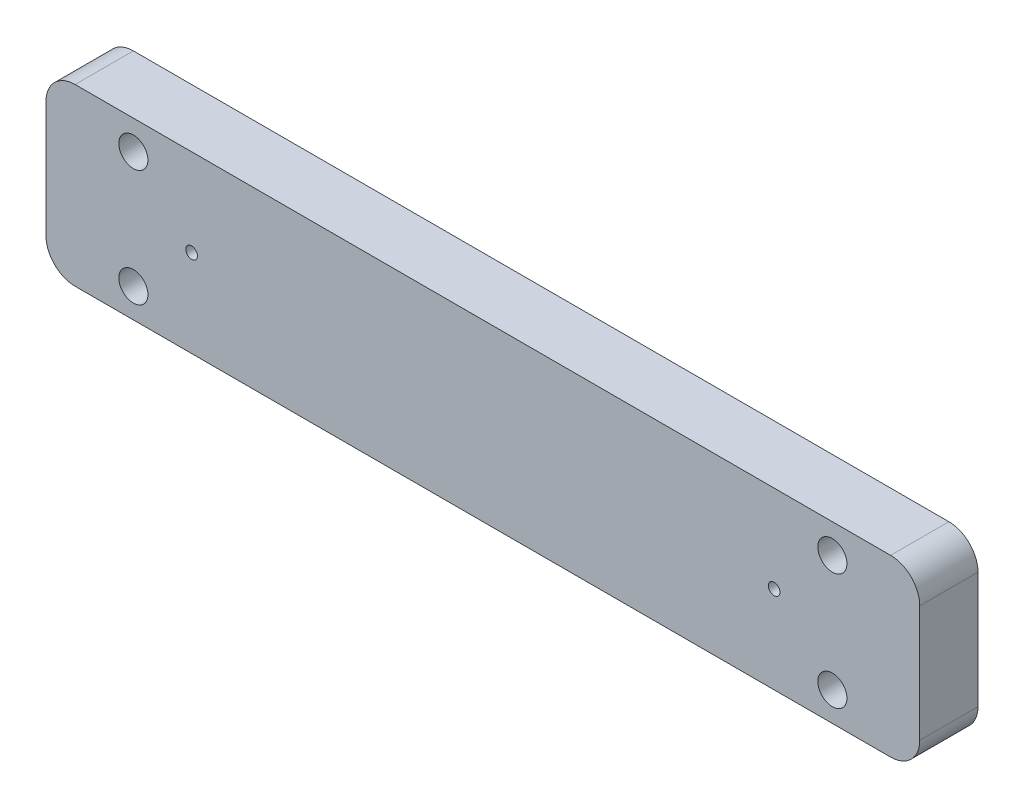
ISO-10303-21;
HEADER;
FILE_DESCRIPTION(('STEP AP214'),'2;1');
FILE_NAME('part.step','',(''),(''),'','','');
FILE_SCHEMA(('AUTOMOTIVE_DESIGN { 1 0 10303 214 1 1 1 1 }'));
ENDSEC;
DATA;
#1=APPLICATION_CONTEXT('core data for automotive mechanical design processes');
#2=APPLICATION_PROTOCOL_DEFINITION('international standard','automotive_design',2000,#1);
#3=PRODUCT_CONTEXT('',#1,'mechanical');
#4=PRODUCT('Part','Part','',(#3));
#5=PRODUCT_RELATED_PRODUCT_CATEGORY('part','',(#4));
#6=PRODUCT_DEFINITION_FORMATION('','',#4);
#7=PRODUCT_DEFINITION_CONTEXT('part definition',#1,'design');
#8=PRODUCT_DEFINITION('design','',#6,#7);
#9=PRODUCT_DEFINITION_SHAPE('','',#8);
#10=(LENGTH_UNIT() NAMED_UNIT(*) SI_UNIT(.MILLI.,.METRE.));
#11=(NAMED_UNIT(*) PLANE_ANGLE_UNIT() SI_UNIT($,.RADIAN.));
#12=(NAMED_UNIT(*) SI_UNIT($,.STERADIAN.) SOLID_ANGLE_UNIT());
#13=UNCERTAINTY_MEASURE_WITH_UNIT(LENGTH_MEASURE(1.E-05),#10,'distance_accuracy_value','');
#14=(GEOMETRIC_REPRESENTATION_CONTEXT(3) GLOBAL_UNCERTAINTY_ASSIGNED_CONTEXT((#13)) GLOBAL_UNIT_ASSIGNED_CONTEXT((#10,
#11,#12)) REPRESENTATION_CONTEXT('',''));
#15=CARTESIAN_POINT('',(0.,0.,0.));
#16=DIRECTION('',(0.,0.,1.));
#17=DIRECTION('',(1.,0.,0.));
#18=AXIS2_PLACEMENT_3D('',#15,#16,#17);
#19=CARTESIAN_POINT('',(145.,5.,10.));
#20=DIRECTION('',(0.,0.,1.));
#21=DIRECTION('',(1.,0.,0.));
#22=AXIS2_PLACEMENT_3D('',#19,#20,#21);
#23=PLANE('',#22);
#24=CARTESIAN_POINT('',(15.,5.,10.));
#25=DIRECTION('',(0.,0.,1.));
#26=DIRECTION('',(1.,0.,0.));
#27=AXIS2_PLACEMENT_3D('',#24,#25,#26);
#28=CIRCLE('',#27,2.5);
#29=CARTESIAN_POINT('',(17.5,5.,10.));
#30=VERTEX_POINT('',#29);
#31=EDGE_CURVE('E204',#30,#30,#28,.T.);
#32=ORIENTED_EDGE('',*,*,#31,.F.);
#33=EDGE_LOOP('',(#32));
#34=FACE_BOUND('',#33,.T.);
#35=CARTESIAN_POINT('',(135.,25.,10.));
#36=DIRECTION('',(0.,0.,1.));
#37=DIRECTION('',(1.,0.,0.));
#38=AXIS2_PLACEMENT_3D('',#35,#36,#37);
#39=CIRCLE('',#38,2.5);
#40=CARTESIAN_POINT('',(137.5,25.,10.));
#41=VERTEX_POINT('',#40);
#42=EDGE_CURVE('E197',#41,#41,#39,.T.);
#43=ORIENTED_EDGE('',*,*,#42,.F.);
#44=EDGE_LOOP('',(#43));
#45=FACE_BOUND('',#44,.T.);
#46=CARTESIAN_POINT('',(135.,5.,10.));
#47=DIRECTION('',(0.,0.,1.));
#48=DIRECTION('',(1.,0.,0.));
#49=AXIS2_PLACEMENT_3D('',#46,#47,#48);
#50=CIRCLE('',#49,2.5);
#51=CARTESIAN_POINT('',(137.5,5.,10.));
#52=VERTEX_POINT('',#51);
#53=EDGE_CURVE('E209',#52,#52,#50,.T.);
#54=ORIENTED_EDGE('',*,*,#53,.F.);
#55=EDGE_LOOP('',(#54));
#56=FACE_BOUND('',#55,.T.);
#57=CARTESIAN_POINT('',(15.,25.,10.));
#58=DIRECTION('',(0.,0.,1.));
#59=DIRECTION('',(1.,0.,0.));
#60=AXIS2_PLACEMENT_3D('',#57,#58,#59);
#61=CIRCLE('',#60,2.5);
#62=CARTESIAN_POINT('',(17.5,25.,10.));
#63=VERTEX_POINT('',#62);
#64=EDGE_CURVE('E191',#63,#63,#61,.T.);
#65=ORIENTED_EDGE('',*,*,#64,.F.);
#66=EDGE_LOOP('',(#65));
#67=FACE_BOUND('',#66,.T.);
#68=CARTESIAN_POINT('',(25.,15.,10.));
#69=DIRECTION('',(0.,0.,1.));
#70=DIRECTION('',(1.,0.,0.));
#71=AXIS2_PLACEMENT_3D('',#68,#69,#70);
#72=CIRCLE('',#71,1.);
#73=CARTESIAN_POINT('',(26.,15.,10.));
#74=VERTEX_POINT('',#73);
#75=EDGE_CURVE('E134',#74,#74,#72,.T.);
#76=ORIENTED_EDGE('',*,*,#75,.F.);
#77=EDGE_LOOP('',(#76));
#78=FACE_BOUND('',#77,.T.);
#79=CARTESIAN_POINT('',(145.,5.,10.));
#80=DIRECTION('',(0.,0.,1.));
#81=DIRECTION('',(1.,0.,0.));
#82=AXIS2_PLACEMENT_3D('',#79,#80,#81);
#83=CIRCLE('',#82,5.);
#84=CARTESIAN_POINT('',(145.,0.,10.));
#85=VERTEX_POINT('',#84);
#86=CARTESIAN_POINT('',(150.,5.00000000000004,10.));
#87=VERTEX_POINT('',#86);
#88=EDGE_CURVE('E145',#85,#87,#83,.T.);
#89=ORIENTED_EDGE('',*,*,#88,.T.);
#90=DIRECTION('',(0.,1.,0.));
#91=VECTOR('',#90,1.);
#92=CARTESIAN_POINT('',(150.,5.00000000000004,10.));
#93=LINE('',#92,#91);
#94=CARTESIAN_POINT('',(150.,25.,10.));
#95=VERTEX_POINT('',#94);
#96=EDGE_CURVE('E93',#87,#95,#93,.T.);
#97=ORIENTED_EDGE('',*,*,#96,.T.);
#98=CARTESIAN_POINT('',(145.,25.,10.));
#99=DIRECTION('',(0.,0.,1.));
#100=DIRECTION('',(-1.,0.,0.));
#101=AXIS2_PLACEMENT_3D('',#98,#99,#100);
#102=CIRCLE('',#101,5.);
#103=CARTESIAN_POINT('',(145.,30.,10.));
#104=VERTEX_POINT('',#103);
#105=EDGE_CURVE('E160',#95,#104,#102,.T.);
#106=ORIENTED_EDGE('',*,*,#105,.T.);
#107=DIRECTION('',(-1.,0.,0.));
#108=VECTOR('',#107,1.);
#109=CARTESIAN_POINT('',(5.,30.,10.));
#110=LINE('',#109,#108);
#111=CARTESIAN_POINT('',(5.,30.,10.));
#112=VERTEX_POINT('',#111);
#113=EDGE_CURVE('E173',#104,#112,#110,.T.);
#114=ORIENTED_EDGE('',*,*,#113,.T.);
#115=CARTESIAN_POINT('',(5.,25.,10.));
#116=DIRECTION('',(0.,0.,1.));
#117=DIRECTION('',(-1.,0.,0.));
#118=AXIS2_PLACEMENT_3D('',#115,#116,#117);
#119=CIRCLE('',#118,5.);
#120=CARTESIAN_POINT('',(0.,25.,10.));
#121=VERTEX_POINT('',#120);
#122=EDGE_CURVE('E112',#112,#121,#119,.T.);
#123=ORIENTED_EDGE('',*,*,#122,.T.);
#124=DIRECTION('',(0.,-1.,0.));
#125=VECTOR('',#124,1.);
#126=CARTESIAN_POINT('',(0.,5.00000000000004,10.));
#127=LINE('',#126,#125);
#128=CARTESIAN_POINT('',(0.,5.,10.));
#129=VERTEX_POINT('',#128);
#130=EDGE_CURVE('E106',#121,#129,#127,.T.);
#131=ORIENTED_EDGE('',*,*,#130,.T.);
#132=CARTESIAN_POINT('',(5.,5.,10.));
#133=DIRECTION('',(0.,0.,1.));
#134=DIRECTION('',(-1.,0.,0.));
#135=AXIS2_PLACEMENT_3D('',#132,#133,#134);
#136=CIRCLE('',#135,5.);
#137=CARTESIAN_POINT('',(5.00000000000004,0.,10.));
#138=VERTEX_POINT('',#137);
#139=EDGE_CURVE('E110',#129,#138,#136,.T.);
#140=ORIENTED_EDGE('',*,*,#139,.T.);
#141=DIRECTION('',(1.,0.,0.));
#142=VECTOR('',#141,1.);
#143=CARTESIAN_POINT('',(5.00000000000004,0.,10.));
#144=LINE('',#143,#142);
#145=EDGE_CURVE('E50',#138,#85,#144,.T.);
#146=ORIENTED_EDGE('',*,*,#145,.T.);
#147=EDGE_LOOP('',(#89,#97,#106,#114,#123,#131,#140,#146));
#148=FACE_BOUND('',#147,.T.);
#149=CARTESIAN_POINT('',(125.,15.,10.));
#150=DIRECTION('',(0.,0.,1.));
#151=DIRECTION('',(1.,0.,0.));
#152=AXIS2_PLACEMENT_3D('',#149,#150,#151);
#153=CIRCLE('',#152,0.999999999999998);
#154=CARTESIAN_POINT('',(126.,15.,10.));
#155=VERTEX_POINT('',#154);
#156=EDGE_CURVE('E182',#155,#155,#153,.T.);
#157=ORIENTED_EDGE('',*,*,#156,.F.);
#158=EDGE_LOOP('',(#157));
#159=FACE_BOUND('',#158,.T.);
#160=ADVANCED_FACE('F33',(#34,#45,#56,#67,#78,#148,#159),#23,.T.);
#161=CARTESIAN_POINT('',(145.,5.,0.));
#162=DIRECTION('',(0.,0.,1.));
#163=DIRECTION('',(1.,0.,0.));
#164=AXIS2_PLACEMENT_3D('',#161,#162,#163);
#165=PLANE('',#164);
#166=CARTESIAN_POINT('',(15.,5.,0.));
#167=DIRECTION('',(0.,0.,1.));
#168=DIRECTION('',(1.,0.,0.));
#169=AXIS2_PLACEMENT_3D('',#166,#167,#168);
#170=CIRCLE('',#169,2.5);
#171=CARTESIAN_POINT('',(17.5,5.,0.));
#172=VERTEX_POINT('',#171);
#173=EDGE_CURVE('E194',#172,#172,#170,.T.);
#174=ORIENTED_EDGE('',*,*,#173,.T.);
#175=EDGE_LOOP('',(#174));
#176=FACE_BOUND('',#175,.T.);
#177=CARTESIAN_POINT('',(135.,25.,0.));
#178=DIRECTION('',(0.,0.,1.));
#179=DIRECTION('',(1.,0.,0.));
#180=AXIS2_PLACEMENT_3D('',#177,#178,#179);
#181=CIRCLE('',#180,2.5);
#182=CARTESIAN_POINT('',(137.5,25.,0.));
#183=VERTEX_POINT('',#182);
#184=EDGE_CURVE('E200',#183,#183,#181,.T.);
#185=ORIENTED_EDGE('',*,*,#184,.T.);
#186=EDGE_LOOP('',(#185));
#187=FACE_BOUND('',#186,.T.);
#188=CARTESIAN_POINT('',(135.,5.,0.));
#189=DIRECTION('',(0.,0.,1.));
#190=DIRECTION('',(1.,0.,0.));
#191=AXIS2_PLACEMENT_3D('',#188,#189,#190);
#192=CIRCLE('',#191,2.5);
#193=CARTESIAN_POINT('',(137.5,5.,0.));
#194=VERTEX_POINT('',#193);
#195=EDGE_CURVE('E201',#194,#194,#192,.T.);
#196=ORIENTED_EDGE('',*,*,#195,.T.);
#197=EDGE_LOOP('',(#196));
#198=FACE_BOUND('',#197,.T.);
#199=CARTESIAN_POINT('',(15.,25.,0.));
#200=DIRECTION('',(0.,0.,1.));
#201=DIRECTION('',(1.,0.,0.));
#202=AXIS2_PLACEMENT_3D('',#199,#200,#201);
#203=CIRCLE('',#202,2.5);
#204=CARTESIAN_POINT('',(17.5,25.,0.));
#205=VERTEX_POINT('',#204);
#206=EDGE_CURVE('E188',#205,#205,#203,.T.);
#207=ORIENTED_EDGE('',*,*,#206,.T.);
#208=EDGE_LOOP('',(#207));
#209=FACE_BOUND('',#208,.T.);
#210=CARTESIAN_POINT('',(145.,5.,0.));
#211=DIRECTION('',(0.,0.,1.));
#212=DIRECTION('',(1.,0.,0.));
#213=AXIS2_PLACEMENT_3D('',#210,#211,#212);
#214=CIRCLE('',#213,5.);
#215=CARTESIAN_POINT('',(145.,0.,0.));
#216=VERTEX_POINT('',#215);
#217=CARTESIAN_POINT('',(150.,5.00000000000004,0.));
#218=VERTEX_POINT('',#217);
#219=EDGE_CURVE('E130',#216,#218,#214,.T.);
#220=ORIENTED_EDGE('',*,*,#219,.F.);
#221=DIRECTION('',(1.,0.,0.));
#222=VECTOR('',#221,1.);
#223=CARTESIAN_POINT('',(5.00000000000004,0.,0.));
#224=LINE('',#223,#222);
#225=CARTESIAN_POINT('',(5.00000000000004,0.,0.));
#226=VERTEX_POINT('',#225);
#227=EDGE_CURVE('E85',#226,#216,#224,.T.);
#228=ORIENTED_EDGE('',*,*,#227,.F.);
#229=CARTESIAN_POINT('',(5.,5.,0.));
#230=DIRECTION('',(0.,0.,1.));
#231=DIRECTION('',(-1.,0.,0.));
#232=AXIS2_PLACEMENT_3D('',#229,#230,#231);
#233=CIRCLE('',#232,5.);
#234=CARTESIAN_POINT('',(0.,5.,0.));
#235=VERTEX_POINT('',#234);
#236=EDGE_CURVE('E79',#235,#226,#233,.T.);
#237=ORIENTED_EDGE('',*,*,#236,.F.);
#238=DIRECTION('',(0.,-1.,0.));
#239=VECTOR('',#238,1.);
#240=CARTESIAN_POINT('',(0.,5.00000000000004,0.));
#241=LINE('',#240,#239);
#242=CARTESIAN_POINT('',(0.,25.,0.));
#243=VERTEX_POINT('',#242);
#244=EDGE_CURVE('E120',#243,#235,#241,.T.);
#245=ORIENTED_EDGE('',*,*,#244,.F.);
#246=CARTESIAN_POINT('',(5.,25.,0.));
#247=DIRECTION('',(0.,0.,1.));
#248=DIRECTION('',(-1.,0.,0.));
#249=AXIS2_PLACEMENT_3D('',#246,#247,#248);
#250=CIRCLE('',#249,5.);
#251=CARTESIAN_POINT('',(5.,30.,0.));
#252=VERTEX_POINT('',#251);
#253=EDGE_CURVE('E140',#252,#243,#250,.T.);
#254=ORIENTED_EDGE('',*,*,#253,.F.);
#255=DIRECTION('',(-1.,0.,0.));
#256=VECTOR('',#255,1.);
#257=CARTESIAN_POINT('',(5.,30.,0.));
#258=LINE('',#257,#256);
#259=CARTESIAN_POINT('',(145.,30.,0.));
#260=VERTEX_POINT('',#259);
#261=EDGE_CURVE('E138',#260,#252,#258,.T.);
#262=ORIENTED_EDGE('',*,*,#261,.F.);
#263=CARTESIAN_POINT('',(145.,25.,0.));
#264=DIRECTION('',(0.,0.,1.));
#265=DIRECTION('',(-1.,0.,0.));
#266=AXIS2_PLACEMENT_3D('',#263,#264,#265);
#267=CIRCLE('',#266,5.);
#268=CARTESIAN_POINT('',(150.,25.,0.));
#269=VERTEX_POINT('',#268);
#270=EDGE_CURVE('E136',#269,#260,#267,.T.);
#271=ORIENTED_EDGE('',*,*,#270,.F.);
#272=DIRECTION('',(0.,1.,0.));
#273=VECTOR('',#272,1.);
#274=CARTESIAN_POINT('',(150.,5.00000000000004,0.));
#275=LINE('',#274,#273);
#276=EDGE_CURVE('E133',#218,#269,#275,.T.);
#277=ORIENTED_EDGE('',*,*,#276,.F.);
#278=EDGE_LOOP('',(#220,#228,#237,#245,#254,#262,#271,#277));
#279=FACE_BOUND('',#278,.T.);
#280=CARTESIAN_POINT('',(25.,15.,0.));
#281=DIRECTION('',(0.,0.,1.));
#282=DIRECTION('',(1.,0.,0.));
#283=AXIS2_PLACEMENT_3D('',#280,#281,#282);
#284=CIRCLE('',#283,1.);
#285=CARTESIAN_POINT('',(26.,15.,0.));
#286=VERTEX_POINT('',#285);
#287=EDGE_CURVE('E179',#286,#286,#284,.T.);
#288=ORIENTED_EDGE('',*,*,#287,.T.);
#289=EDGE_LOOP('',(#288));
#290=FACE_BOUND('',#289,.T.);
#291=CARTESIAN_POINT('',(125.,15.,0.));
#292=DIRECTION('',(0.,0.,1.));
#293=DIRECTION('',(1.,0.,0.));
#294=AXIS2_PLACEMENT_3D('',#291,#292,#293);
#295=CIRCLE('',#294,0.999999999999998);
#296=CARTESIAN_POINT('',(126.,15.,0.));
#297=VERTEX_POINT('',#296);
#298=EDGE_CURVE('E185',#297,#297,#295,.T.);
#299=ORIENTED_EDGE('',*,*,#298,.T.);
#300=EDGE_LOOP('',(#299));
#301=FACE_BOUND('',#300,.T.);
#302=ADVANCED_FACE('F164',(#176,#187,#198,#209,#279,#290,#301),#165,.F.);
#303=CARTESIAN_POINT('',(145.,5.,10.));
#304=DIRECTION('',(0.,0.,-1.));
#305=DIRECTION('',(-1.,0.,0.));
#306=AXIS2_PLACEMENT_3D('',#303,#304,#305);
#307=CYLINDRICAL_SURFACE('',#306,5.);
#308=ORIENTED_EDGE('',*,*,#219,.T.);
#309=DIRECTION('',(0.,0.,-1.));
#310=VECTOR('',#309,1.);
#311=CARTESIAN_POINT('',(150.,5.00000000000004,10.));
#312=LINE('',#311,#310);
#313=EDGE_CURVE('E11',#87,#218,#312,.T.);
#314=ORIENTED_EDGE('',*,*,#313,.F.);
#315=ORIENTED_EDGE('',*,*,#88,.F.);
#316=DIRECTION('',(0.,0.,-1.));
#317=VECTOR('',#316,1.);
#318=CARTESIAN_POINT('',(145.,0.,10.));
#319=LINE('',#318,#317);
#320=EDGE_CURVE('E126',#85,#216,#319,.T.);
#321=ORIENTED_EDGE('',*,*,#320,.T.);
#322=EDGE_LOOP('',(#308,#314,#315,#321));
#323=FACE_BOUND('',#322,.T.);
#324=ADVANCED_FACE('F35',(#323),#307,.T.);
#325=CARTESIAN_POINT('',(150.,5.00000000000004,10.));
#326=DIRECTION('',(-1.,0.,0.));
#327=DIRECTION('',(0.,0.,1.));
#328=AXIS2_PLACEMENT_3D('',#325,#326,#327);
#329=PLANE('',#328);
#330=ORIENTED_EDGE('',*,*,#276,.T.);
#331=DIRECTION('',(0.,0.,-1.));
#332=VECTOR('',#331,1.);
#333=CARTESIAN_POINT('',(150.,25.,10.));
#334=LINE('',#333,#332);
#335=EDGE_CURVE('E42',#95,#269,#334,.T.);
#336=ORIENTED_EDGE('',*,*,#335,.F.);
#337=ORIENTED_EDGE('',*,*,#96,.F.);
#338=ORIENTED_EDGE('',*,*,#313,.T.);
#339=EDGE_LOOP('',(#330,#336,#337,#338));
#340=FACE_BOUND('',#339,.T.);
#341=ADVANCED_FACE('F267',(#340),#329,.F.);
#342=CARTESIAN_POINT('',(145.,25.,10.));
#343=DIRECTION('',(0.,0.,-1.));
#344=DIRECTION('',(-1.,0.,0.));
#345=AXIS2_PLACEMENT_3D('',#342,#343,#344);
#346=CYLINDRICAL_SURFACE('',#345,5.);
#347=ORIENTED_EDGE('',*,*,#270,.T.);
#348=DIRECTION('',(0.,0.,-1.));
#349=VECTOR('',#348,1.);
#350=CARTESIAN_POINT('',(145.,30.,10.));
#351=LINE('',#350,#349);
#352=EDGE_CURVE('E152',#104,#260,#351,.T.);
#353=ORIENTED_EDGE('',*,*,#352,.F.);
#354=ORIENTED_EDGE('',*,*,#105,.F.);
#355=ORIENTED_EDGE('',*,*,#335,.T.);
#356=EDGE_LOOP('',(#347,#353,#354,#355));
#357=FACE_BOUND('',#356,.T.);
#358=ADVANCED_FACE('F158',(#357),#346,.T.);
#359=CARTESIAN_POINT('',(5.,30.,10.));
#360=DIRECTION('',(0.,-1.,0.));
#361=DIRECTION('',(0.,0.,-1.));
#362=AXIS2_PLACEMENT_3D('',#359,#360,#361);
#363=PLANE('',#362);
#364=ORIENTED_EDGE('',*,*,#261,.T.);
#365=DIRECTION('',(0.,0.,-1.));
#366=VECTOR('',#365,1.);
#367=CARTESIAN_POINT('',(5.,30.,10.));
#368=LINE('',#367,#366);
#369=EDGE_CURVE('E149',#112,#252,#368,.T.);
#370=ORIENTED_EDGE('',*,*,#369,.F.);
#371=ORIENTED_EDGE('',*,*,#113,.F.);
#372=ORIENTED_EDGE('',*,*,#352,.T.);
#373=EDGE_LOOP('',(#364,#370,#371,#372));
#374=FACE_BOUND('',#373,.T.);
#375=ADVANCED_FACE('F169',(#374),#363,.F.);
#376=CARTESIAN_POINT('',(5.,25.,10.));
#377=DIRECTION('',(0.,0.,-1.));
#378=DIRECTION('',(-1.,0.,0.));
#379=AXIS2_PLACEMENT_3D('',#376,#377,#378);
#380=CYLINDRICAL_SURFACE('',#379,5.);
#381=ORIENTED_EDGE('',*,*,#253,.T.);
#382=DIRECTION('',(0.,0.,-1.));
#383=VECTOR('',#382,1.);
#384=CARTESIAN_POINT('',(0.,25.,10.));
#385=LINE('',#384,#383);
#386=EDGE_CURVE('E121',#121,#243,#385,.T.);
#387=ORIENTED_EDGE('',*,*,#386,.F.);
#388=ORIENTED_EDGE('',*,*,#122,.F.);
#389=ORIENTED_EDGE('',*,*,#369,.T.);
#390=EDGE_LOOP('',(#381,#387,#388,#389));
#391=FACE_BOUND('',#390,.T.);
#392=ADVANCED_FACE('F172',(#391),#380,.T.);
#393=CARTESIAN_POINT('',(0.,5.00000000000004,10.));
#394=DIRECTION('',(1.,0.,0.));
#395=DIRECTION('',(0.,0.,-1.));
#396=AXIS2_PLACEMENT_3D('',#393,#394,#395);
#397=PLANE('',#396);
#398=ORIENTED_EDGE('',*,*,#244,.T.);
#399=DIRECTION('',(0.,0.,-1.));
#400=VECTOR('',#399,1.);
#401=CARTESIAN_POINT('',(0.,5.,10.));
#402=LINE('',#401,#400);
#403=EDGE_CURVE('E117',#129,#235,#402,.T.);
#404=ORIENTED_EDGE('',*,*,#403,.F.);
#405=ORIENTED_EDGE('',*,*,#130,.F.);
#406=ORIENTED_EDGE('',*,*,#386,.T.);
#407=EDGE_LOOP('',(#398,#404,#405,#406));
#408=FACE_BOUND('',#407,.T.);
#409=ADVANCED_FACE('F118',(#408),#397,.F.);
#410=CARTESIAN_POINT('',(5.,5.,10.));
#411=DIRECTION('',(0.,0.,-1.));
#412=DIRECTION('',(-1.,0.,0.));
#413=AXIS2_PLACEMENT_3D('',#410,#411,#412);
#414=CYLINDRICAL_SURFACE('',#413,5.);
#415=ORIENTED_EDGE('',*,*,#236,.T.);
#416=DIRECTION('',(0.,0.,-1.));
#417=VECTOR('',#416,1.);
#418=CARTESIAN_POINT('',(5.00000000000004,0.,10.));
#419=LINE('',#418,#417);
#420=EDGE_CURVE('E122',#138,#226,#419,.T.);
#421=ORIENTED_EDGE('',*,*,#420,.F.);
#422=ORIENTED_EDGE('',*,*,#139,.F.);
#423=ORIENTED_EDGE('',*,*,#403,.T.);
#424=EDGE_LOOP('',(#415,#421,#422,#423));
#425=FACE_BOUND('',#424,.T.);
#426=ADVANCED_FACE('F124',(#425),#414,.T.);
#427=CARTESIAN_POINT('',(5.00000000000004,0.,10.));
#428=DIRECTION('',(0.,1.,0.));
#429=DIRECTION('',(0.,0.,1.));
#430=AXIS2_PLACEMENT_3D('',#427,#428,#429);
#431=PLANE('',#430);
#432=ORIENTED_EDGE('',*,*,#227,.T.);
#433=ORIENTED_EDGE('',*,*,#320,.F.);
#434=ORIENTED_EDGE('',*,*,#145,.F.);
#435=ORIENTED_EDGE('',*,*,#420,.T.);
#436=EDGE_LOOP('',(#432,#433,#434,#435));
#437=FACE_BOUND('',#436,.T.);
#438=ADVANCED_FACE('F237',(#437),#431,.F.);
#439=CARTESIAN_POINT('',(25.,15.,10.));
#440=DIRECTION('',(0.,0.,-1.));
#441=DIRECTION('',(-1.,0.,0.));
#442=AXIS2_PLACEMENT_3D('',#439,#440,#441);
#443=CYLINDRICAL_SURFACE('',#442,1.);
#444=ORIENTED_EDGE('',*,*,#75,.T.);
#445=EDGE_LOOP('',(#444));
#446=FACE_BOUND('',#445,.T.);
#447=ORIENTED_EDGE('',*,*,#287,.F.);
#448=EDGE_LOOP('',(#447));
#449=FACE_BOUND('',#448,.T.);
#450=ADVANCED_FACE('F233',(#446,#449),#443,.F.);
#451=CARTESIAN_POINT('',(125.,15.,10.));
#452=DIRECTION('',(0.,0.,-1.));
#453=DIRECTION('',(-1.,0.,0.));
#454=AXIS2_PLACEMENT_3D('',#451,#452,#453);
#455=CYLINDRICAL_SURFACE('',#454,0.999999999999998);
#456=ORIENTED_EDGE('',*,*,#156,.T.);
#457=EDGE_LOOP('',(#456));
#458=FACE_BOUND('',#457,.T.);
#459=ORIENTED_EDGE('',*,*,#298,.F.);
#460=EDGE_LOOP('',(#459));
#461=FACE_BOUND('',#460,.T.);
#462=ADVANCED_FACE('F236',(#458,#461),#455,.F.);
#463=CARTESIAN_POINT('',(15.,25.,0.));
#464=DIRECTION('',(0.,0.,1.));
#465=DIRECTION('',(1.,0.,0.));
#466=AXIS2_PLACEMENT_3D('',#463,#464,#465);
#467=CYLINDRICAL_SURFACE('',#466,2.5);
#468=ORIENTED_EDGE('',*,*,#206,.F.);
#469=EDGE_LOOP('',(#468));
#470=FACE_BOUND('',#469,.T.);
#471=ORIENTED_EDGE('',*,*,#64,.T.);
#472=EDGE_LOOP('',(#471));
#473=FACE_BOUND('',#472,.T.);
#474=ADVANCED_FACE('F221',(#470,#473),#467,.F.);
#475=CARTESIAN_POINT('',(135.,5.,0.));
#476=DIRECTION('',(0.,0.,1.));
#477=DIRECTION('',(1.,0.,0.));
#478=AXIS2_PLACEMENT_3D('',#475,#476,#477);
#479=CYLINDRICAL_SURFACE('',#478,2.5);
#480=ORIENTED_EDGE('',*,*,#195,.F.);
#481=EDGE_LOOP('',(#480));
#482=FACE_BOUND('',#481,.T.);
#483=ORIENTED_EDGE('',*,*,#53,.T.);
#484=EDGE_LOOP('',(#483));
#485=FACE_BOUND('',#484,.T.);
#486=ADVANCED_FACE('F217',(#482,#485),#479,.F.);
#487=CARTESIAN_POINT('',(135.,25.,0.));
#488=DIRECTION('',(0.,0.,1.));
#489=DIRECTION('',(1.,0.,0.));
#490=AXIS2_PLACEMENT_3D('',#487,#488,#489);
#491=CYLINDRICAL_SURFACE('',#490,2.5);
#492=ORIENTED_EDGE('',*,*,#184,.F.);
#493=EDGE_LOOP('',(#492));
#494=FACE_BOUND('',#493,.T.);
#495=ORIENTED_EDGE('',*,*,#42,.T.);
#496=EDGE_LOOP('',(#495));
#497=FACE_BOUND('',#496,.T.);
#498=ADVANCED_FACE('F220',(#494,#497),#491,.F.);
#499=CARTESIAN_POINT('',(15.,5.,0.));
#500=DIRECTION('',(0.,0.,1.));
#501=DIRECTION('',(1.,0.,0.));
#502=AXIS2_PLACEMENT_3D('',#499,#500,#501);
#503=CYLINDRICAL_SURFACE('',#502,2.5);
#504=ORIENTED_EDGE('',*,*,#173,.F.);
#505=EDGE_LOOP('',(#504));
#506=FACE_BOUND('',#505,.T.);
#507=ORIENTED_EDGE('',*,*,#31,.T.);
#508=EDGE_LOOP('',(#507));
#509=FACE_BOUND('',#508,.T.);
#510=ADVANCED_FACE('F359',(#506,#509),#503,.F.);
#511=CLOSED_SHELL('',(#160,#302,#324,#341,#358,#375,#392,#409,#426,#438,#450,#462,#474,#486,
#498,#510));
#512=MANIFOLD_SOLID_BREP('B2',#511);
#513=ADVANCED_BREP_SHAPE_REPRESENTATION('',(#18,#512),#14);
#514=SHAPE_DEFINITION_REPRESENTATION(#9,#513);
ENDSEC;
END-ISO-10303-21;
